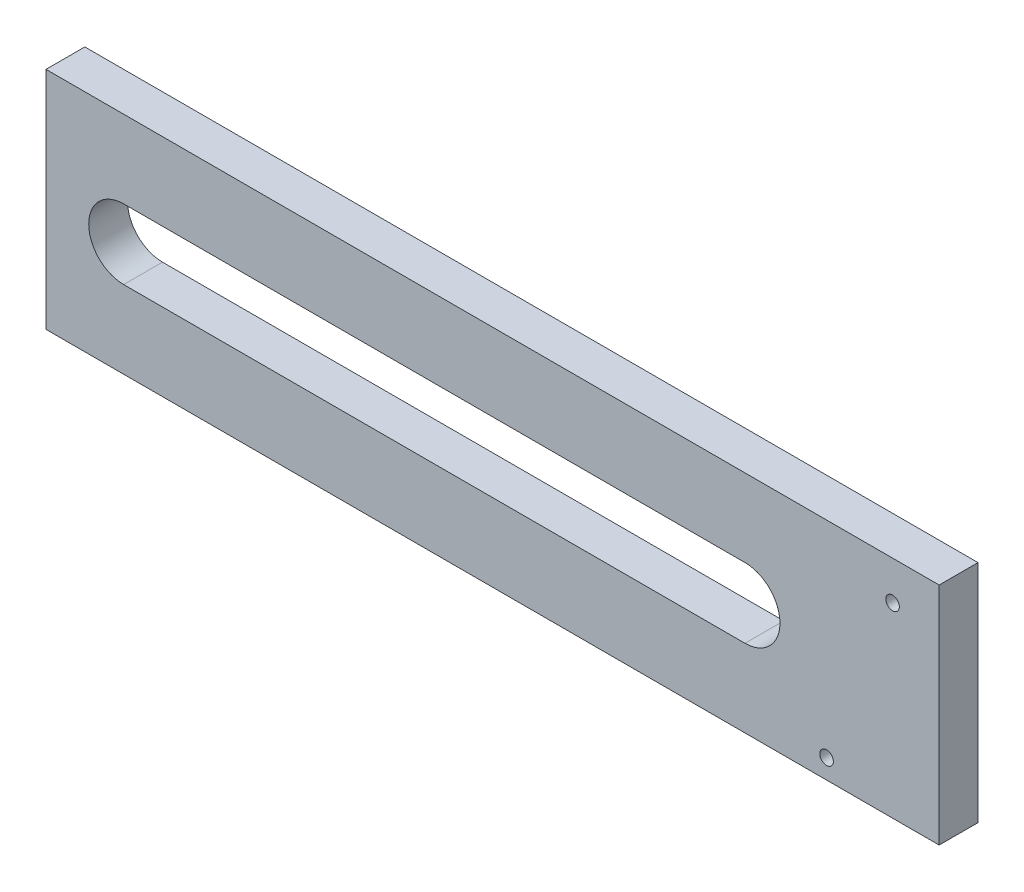
ISO-10303-21;
HEADER;
FILE_DESCRIPTION(('STEP AP214'),'2;1');
FILE_NAME('part.step','',(''),(''),'','','');
FILE_SCHEMA(('AUTOMOTIVE_DESIGN { 1 0 10303 214 1 1 1 1 }'));
ENDSEC;
DATA;
#1=APPLICATION_CONTEXT('core data for automotive mechanical design processes');
#2=APPLICATION_PROTOCOL_DEFINITION('international standard','automotive_design',2000,#1);
#3=PRODUCT_CONTEXT('',#1,'mechanical');
#4=PRODUCT('Part','Part','',(#3));
#5=PRODUCT_RELATED_PRODUCT_CATEGORY('part','',(#4));
#6=PRODUCT_DEFINITION_FORMATION('','',#4);
#7=PRODUCT_DEFINITION_CONTEXT('part definition',#1,'design');
#8=PRODUCT_DEFINITION('design','',#6,#7);
#9=PRODUCT_DEFINITION_SHAPE('','',#8);
#10=(LENGTH_UNIT() NAMED_UNIT(*) SI_UNIT(.MILLI.,.METRE.));
#11=(NAMED_UNIT(*) PLANE_ANGLE_UNIT() SI_UNIT($,.RADIAN.));
#12=(NAMED_UNIT(*) SI_UNIT($,.STERADIAN.) SOLID_ANGLE_UNIT());
#13=UNCERTAINTY_MEASURE_WITH_UNIT(LENGTH_MEASURE(1.E-05),#10,'distance_accuracy_value','');
#14=(GEOMETRIC_REPRESENTATION_CONTEXT(3) GLOBAL_UNCERTAINTY_ASSIGNED_CONTEXT((#13)) GLOBAL_UNIT_ASSIGNED_CONTEXT((#10,
#11,#12)) REPRESENTATION_CONTEXT('',''));
#15=CARTESIAN_POINT('',(0.,0.,0.));
#16=DIRECTION('',(0.,0.,1.));
#17=DIRECTION('',(1.,0.,0.));
#18=AXIS2_PLACEMENT_3D('',#15,#16,#17);
#19=CARTESIAN_POINT('',(-134.287380445586,-28.0215592245437,10.));
#20=DIRECTION('',(0.,0.,1.));
#21=DIRECTION('',(1.,0.,0.));
#22=AXIS2_PLACEMENT_3D('',#19,#20,#21);
#23=PLANE('',#22);
#24=CARTESIAN_POINT('',(83.712619554414,19.9784407754563,10.));
#25=DIRECTION('',(0.,0.,1.));
#26=DIRECTION('',(1.,0.,0.));
#27=AXIS2_PLACEMENT_3D('',#24,#25,#26);
#28=CIRCLE('',#27,1.75);
#29=CARTESIAN_POINT('',(85.462619554414,19.9784407754563,10.));
#30=VERTEX_POINT('',#29);
#31=EDGE_CURVE('E125',#30,#30,#28,.T.);
#32=ORIENTED_EDGE('',*,*,#31,.F.);
#33=EDGE_LOOP('',(#32));
#34=FACE_BOUND('',#33,.T.);
#35=DIRECTION('',(0.,-1.,0.));
#36=VECTOR('',#35,1.);
#37=CARTESIAN_POINT('',(-134.287380445586,29.9784407754563,10.));
#38=LINE('',#37,#36);
#39=CARTESIAN_POINT('',(-134.287380445586,29.9784407754563,10.));
#40=VERTEX_POINT('',#39);
#41=CARTESIAN_POINT('',(-134.287380445586,-28.0215592245437,10.));
#42=VERTEX_POINT('',#41);
#43=EDGE_CURVE('E135',#40,#42,#38,.T.);
#44=ORIENTED_EDGE('',*,*,#43,.T.);
#45=DIRECTION('',(1.,0.,0.));
#46=VECTOR('',#45,1.);
#47=CARTESIAN_POINT('',(-134.287380445586,-28.0215592245437,10.));
#48=LINE('',#47,#46);
#49=CARTESIAN_POINT('',(95.712619554414,-28.0215592245437,10.));
#50=VERTEX_POINT('',#49);
#51=EDGE_CURVE('E138',#42,#50,#48,.T.);
#52=ORIENTED_EDGE('',*,*,#51,.T.);
#53=DIRECTION('',(0.,1.,0.));
#54=VECTOR('',#53,1.);
#55=CARTESIAN_POINT('',(95.712619554414,29.9784407754563,10.));
#56=LINE('',#55,#54);
#57=CARTESIAN_POINT('',(95.712619554414,29.9784407754563,10.));
#58=VERTEX_POINT('',#57);
#59=EDGE_CURVE('E141',#50,#58,#56,.T.);
#60=ORIENTED_EDGE('',*,*,#59,.T.);
#61=DIRECTION('',(-1.,0.,0.));
#62=VECTOR('',#61,1.);
#63=CARTESIAN_POINT('',(-134.287380445586,29.9784407754563,10.));
#64=LINE('',#63,#62);
#65=EDGE_CURVE('E143',#58,#40,#64,.T.);
#66=ORIENTED_EDGE('',*,*,#65,.T.);
#67=EDGE_LOOP('',(#44,#52,#60,#66));
#68=FACE_BOUND('',#67,.T.);
#69=DIRECTION('',(-1.,0.,0.));
#70=VECTOR('',#69,1.);
#71=CARTESIAN_POINT('',(-114.287380445586,9.97844077545633,10.));
#72=LINE('',#71,#70);
#73=CARTESIAN_POINT('',(45.712619554414,9.97844077545633,10.));
#74=VERTEX_POINT('',#73);
#75=CARTESIAN_POINT('',(-114.287380445586,9.97844077545633,10.));
#76=VERTEX_POINT('',#75);
#77=EDGE_CURVE('E104',#74,#76,#72,.T.);
#78=ORIENTED_EDGE('',*,*,#77,.F.);
#79=CARTESIAN_POINT('',(45.712619554414,0.97844077545633,10.));
#80=DIRECTION('',(0.,0.,1.));
#81=DIRECTION('',(-1.,0.,0.));
#82=AXIS2_PLACEMENT_3D('',#79,#80,#81);
#83=CIRCLE('',#82,9.);
#84=CARTESIAN_POINT('',(45.712619554414,-8.02155922454367,10.));
#85=VERTEX_POINT('',#84);
#86=EDGE_CURVE('E96',#85,#74,#83,.T.);
#87=ORIENTED_EDGE('',*,*,#86,.F.);
#88=DIRECTION('',(1.,0.,0.));
#89=VECTOR('',#88,1.);
#90=CARTESIAN_POINT('',(45.712619554414,-8.02155922454367,10.));
#91=LINE('',#90,#89);
#92=CARTESIAN_POINT('',(-114.287380445586,-8.02155922454369,10.));
#93=VERTEX_POINT('',#92);
#94=EDGE_CURVE('E119',#93,#85,#91,.T.);
#95=ORIENTED_EDGE('',*,*,#94,.F.);
#96=CARTESIAN_POINT('',(-114.287380445586,0.978440775456321,10.));
#97=DIRECTION('',(0.,0.,1.));
#98=DIRECTION('',(1.,0.,0.));
#99=AXIS2_PLACEMENT_3D('',#96,#97,#98);
#100=CIRCLE('',#99,9.00000000000001);
#101=EDGE_CURVE('E117',#76,#93,#100,.T.);
#102=ORIENTED_EDGE('',*,*,#101,.F.);
#103=EDGE_LOOP('',(#78,#87,#95,#102));
#104=FACE_BOUND('',#103,.T.);
#105=CARTESIAN_POINT('',(66.712619554414,-23.0215592245437,10.));
#106=DIRECTION('',(0.,0.,1.));
#107=DIRECTION('',(1.,0.,0.));
#108=AXIS2_PLACEMENT_3D('',#105,#106,#107);
#109=CIRCLE('',#108,1.75);
#110=CARTESIAN_POINT('',(68.462619554414,-23.0215592245437,10.));
#111=VERTEX_POINT('',#110);
#112=EDGE_CURVE('E226',#111,#111,#109,.T.);
#113=ORIENTED_EDGE('',*,*,#112,.F.);
#114=EDGE_LOOP('',(#113));
#115=FACE_BOUND('',#114,.T.);
#116=ADVANCED_FACE('F31',(#34,#68,#104,#115),#23,.T.);
#117=CARTESIAN_POINT('',(-134.287380445586,-28.0215592245437,0.));
#118=DIRECTION('',(0.,0.,1.));
#119=DIRECTION('',(1.,0.,0.));
#120=AXIS2_PLACEMENT_3D('',#117,#118,#119);
#121=PLANE('',#120);
#122=CARTESIAN_POINT('',(83.712619554414,19.9784407754563,0.));
#123=DIRECTION('',(0.,0.,1.));
#124=DIRECTION('',(1.,0.,0.));
#125=AXIS2_PLACEMENT_3D('',#122,#123,#124);
#126=CIRCLE('',#125,1.75);
#127=CARTESIAN_POINT('',(85.462619554414,19.9784407754563,0.));
#128=VERTEX_POINT('',#127);
#129=EDGE_CURVE('E232',#128,#128,#126,.T.);
#130=ORIENTED_EDGE('',*,*,#129,.T.);
#131=EDGE_LOOP('',(#130));
#132=FACE_BOUND('',#131,.T.);
#133=DIRECTION('',(0.,-1.,0.));
#134=VECTOR('',#133,1.);
#135=CARTESIAN_POINT('',(-134.287380445586,29.9784407754563,0.));
#136=LINE('',#135,#134);
#137=CARTESIAN_POINT('',(-134.287380445586,29.9784407754563,0.));
#138=VERTEX_POINT('',#137);
#139=CARTESIAN_POINT('',(-134.287380445586,-28.0215592245437,0.));
#140=VERTEX_POINT('',#139);
#141=EDGE_CURVE('E112',#138,#140,#136,.T.);
#142=ORIENTED_EDGE('',*,*,#141,.F.);
#143=DIRECTION('',(-1.,0.,0.));
#144=VECTOR('',#143,1.);
#145=CARTESIAN_POINT('',(-134.287380445586,29.9784407754563,0.));
#146=LINE('',#145,#144);
#147=CARTESIAN_POINT('',(95.712619554414,29.9784407754563,0.));
#148=VERTEX_POINT('',#147);
#149=EDGE_CURVE('E139',#148,#138,#146,.T.);
#150=ORIENTED_EDGE('',*,*,#149,.F.);
#151=DIRECTION('',(0.,1.,0.));
#152=VECTOR('',#151,1.);
#153=CARTESIAN_POINT('',(95.712619554414,29.9784407754563,0.));
#154=LINE('',#153,#152);
#155=CARTESIAN_POINT('',(95.712619554414,-28.0215592245437,0.));
#156=VERTEX_POINT('',#155);
#157=EDGE_CURVE('E150',#156,#148,#154,.T.);
#158=ORIENTED_EDGE('',*,*,#157,.F.);
#159=DIRECTION('',(1.,0.,0.));
#160=VECTOR('',#159,1.);
#161=CARTESIAN_POINT('',(-134.287380445586,-28.0215592245437,0.));
#162=LINE('',#161,#160);
#163=EDGE_CURVE('E148',#140,#156,#162,.T.);
#164=ORIENTED_EDGE('',*,*,#163,.F.);
#165=EDGE_LOOP('',(#142,#150,#158,#164));
#166=FACE_BOUND('',#165,.T.);
#167=CARTESIAN_POINT('',(45.712619554414,0.97844077545633,0.));
#168=DIRECTION('',(0.,0.,1.));
#169=DIRECTION('',(-1.,0.,0.));
#170=AXIS2_PLACEMENT_3D('',#167,#168,#169);
#171=CIRCLE('',#170,9.);
#172=CARTESIAN_POINT('',(45.712619554414,-8.02155922454367,0.));
#173=VERTEX_POINT('',#172);
#174=CARTESIAN_POINT('',(45.712619554414,9.97844077545633,0.));
#175=VERTEX_POINT('',#174);
#176=EDGE_CURVE('E54',#173,#175,#171,.T.);
#177=ORIENTED_EDGE('',*,*,#176,.T.);
#178=DIRECTION('',(-1.,0.,0.));
#179=VECTOR('',#178,1.);
#180=CARTESIAN_POINT('',(-114.287380445586,9.97844077545633,0.));
#181=LINE('',#180,#179);
#182=CARTESIAN_POINT('',(-114.287380445586,9.97844077545633,0.));
#183=VERTEX_POINT('',#182);
#184=EDGE_CURVE('E111',#175,#183,#181,.T.);
#185=ORIENTED_EDGE('',*,*,#184,.T.);
#186=CARTESIAN_POINT('',(-114.287380445586,0.978440775456321,0.));
#187=DIRECTION('',(0.,0.,1.));
#188=DIRECTION('',(1.,0.,0.));
#189=AXIS2_PLACEMENT_3D('',#186,#187,#188);
#190=CIRCLE('',#189,9.00000000000001);
#191=CARTESIAN_POINT('',(-114.287380445586,-8.02155922454369,0.));
#192=VERTEX_POINT('',#191);
#193=EDGE_CURVE('E127',#183,#192,#190,.T.);
#194=ORIENTED_EDGE('',*,*,#193,.T.);
#195=DIRECTION('',(1.,0.,0.));
#196=VECTOR('',#195,1.);
#197=CARTESIAN_POINT('',(45.712619554414,-8.02155922454367,0.));
#198=LINE('',#197,#196);
#199=EDGE_CURVE('E105',#192,#173,#198,.T.);
#200=ORIENTED_EDGE('',*,*,#199,.T.);
#201=EDGE_LOOP('',(#177,#185,#194,#200));
#202=FACE_BOUND('',#201,.T.);
#203=CARTESIAN_POINT('',(66.712619554414,-23.0215592245437,0.));
#204=DIRECTION('',(0.,0.,1.));
#205=DIRECTION('',(1.,0.,0.));
#206=AXIS2_PLACEMENT_3D('',#203,#204,#205);
#207=CIRCLE('',#206,1.75);
#208=CARTESIAN_POINT('',(68.462619554414,-23.0215592245437,0.));
#209=VERTEX_POINT('',#208);
#210=EDGE_CURVE('E229',#209,#209,#207,.T.);
#211=ORIENTED_EDGE('',*,*,#210,.T.);
#212=EDGE_LOOP('',(#211));
#213=FACE_BOUND('',#212,.T.);
#214=ADVANCED_FACE('F168',(#132,#166,#202,#213),#121,.F.);
#215=CARTESIAN_POINT('',(-134.287380445586,29.9784407754563,10.));
#216=DIRECTION('',(1.,0.,0.));
#217=DIRECTION('',(0.,0.,-1.));
#218=AXIS2_PLACEMENT_3D('',#215,#216,#217);
#219=PLANE('',#218);
#220=ORIENTED_EDGE('',*,*,#141,.T.);
#221=DIRECTION('',(0.,0.,-1.));
#222=VECTOR('',#221,1.);
#223=CARTESIAN_POINT('',(-134.287380445586,-28.0215592245437,10.));
#224=LINE('',#223,#222);
#225=EDGE_CURVE('E11',#42,#140,#224,.T.);
#226=ORIENTED_EDGE('',*,*,#225,.F.);
#227=ORIENTED_EDGE('',*,*,#43,.F.);
#228=DIRECTION('',(0.,0.,-1.));
#229=VECTOR('',#228,1.);
#230=CARTESIAN_POINT('',(-134.287380445586,29.9784407754563,10.));
#231=LINE('',#230,#229);
#232=EDGE_CURVE('E145',#40,#138,#231,.T.);
#233=ORIENTED_EDGE('',*,*,#232,.T.);
#234=EDGE_LOOP('',(#220,#226,#227,#233));
#235=FACE_BOUND('',#234,.T.);
#236=ADVANCED_FACE('F33',(#235),#219,.F.);
#237=CARTESIAN_POINT('',(-134.287380445586,-28.0215592245437,10.));
#238=DIRECTION('',(0.,1.,0.));
#239=DIRECTION('',(0.,0.,1.));
#240=AXIS2_PLACEMENT_3D('',#237,#238,#239);
#241=PLANE('',#240);
#242=ORIENTED_EDGE('',*,*,#163,.T.);
#243=DIRECTION('',(0.,0.,-1.));
#244=VECTOR('',#243,1.);
#245=CARTESIAN_POINT('',(95.712619554414,-28.0215592245437,10.));
#246=LINE('',#245,#244);
#247=EDGE_CURVE('E39',#50,#156,#246,.T.);
#248=ORIENTED_EDGE('',*,*,#247,.F.);
#249=ORIENTED_EDGE('',*,*,#51,.F.);
#250=ORIENTED_EDGE('',*,*,#225,.T.);
#251=EDGE_LOOP('',(#242,#248,#249,#250));
#252=FACE_BOUND('',#251,.T.);
#253=ADVANCED_FACE('F178',(#252),#241,.F.);
#254=CARTESIAN_POINT('',(95.712619554414,29.9784407754563,10.));
#255=DIRECTION('',(-1.,0.,0.));
#256=DIRECTION('',(0.,0.,1.));
#257=AXIS2_PLACEMENT_3D('',#254,#255,#256);
#258=PLANE('',#257);
#259=ORIENTED_EDGE('',*,*,#157,.T.);
#260=DIRECTION('',(0.,0.,-1.));
#261=VECTOR('',#260,1.);
#262=CARTESIAN_POINT('',(95.712619554414,29.9784407754563,10.));
#263=LINE('',#262,#261);
#264=EDGE_CURVE('E155',#58,#148,#263,.T.);
#265=ORIENTED_EDGE('',*,*,#264,.F.);
#266=ORIENTED_EDGE('',*,*,#59,.F.);
#267=ORIENTED_EDGE('',*,*,#247,.T.);
#268=EDGE_LOOP('',(#259,#265,#266,#267));
#269=FACE_BOUND('',#268,.T.);
#270=ADVANCED_FACE('F162',(#269),#258,.F.);
#271=CARTESIAN_POINT('',(-134.287380445586,29.9784407754563,10.));
#272=DIRECTION('',(0.,-1.,0.));
#273=DIRECTION('',(0.,0.,-1.));
#274=AXIS2_PLACEMENT_3D('',#271,#272,#273);
#275=PLANE('',#274);
#276=ORIENTED_EDGE('',*,*,#149,.T.);
#277=ORIENTED_EDGE('',*,*,#232,.F.);
#278=ORIENTED_EDGE('',*,*,#65,.F.);
#279=ORIENTED_EDGE('',*,*,#264,.T.);
#280=EDGE_LOOP('',(#276,#277,#278,#279));
#281=FACE_BOUND('',#280,.T.);
#282=ADVANCED_FACE('F172',(#281),#275,.F.);
#283=CARTESIAN_POINT('',(45.712619554414,0.97844077545633,10.));
#284=DIRECTION('',(0.,0.,-1.));
#285=DIRECTION('',(-1.,0.,0.));
#286=AXIS2_PLACEMENT_3D('',#283,#284,#285);
#287=CYLINDRICAL_SURFACE('',#286,9.);
#288=ORIENTED_EDGE('',*,*,#176,.F.);
#289=DIRECTION('',(0.,0.,-1.));
#290=VECTOR('',#289,1.);
#291=CARTESIAN_POINT('',(45.712619554414,-8.02155922454367,10.));
#292=LINE('',#291,#290);
#293=EDGE_CURVE('E100',#85,#173,#292,.T.);
#294=ORIENTED_EDGE('',*,*,#293,.F.);
#295=ORIENTED_EDGE('',*,*,#86,.T.);
#296=DIRECTION('',(0.,0.,-1.));
#297=VECTOR('',#296,1.);
#298=CARTESIAN_POINT('',(45.712619554414,9.97844077545633,10.));
#299=LINE('',#298,#297);
#300=EDGE_CURVE('E99',#74,#175,#299,.T.);
#301=ORIENTED_EDGE('',*,*,#300,.T.);
#302=EDGE_LOOP('',(#288,#294,#295,#301));
#303=FACE_BOUND('',#302,.T.);
#304=ADVANCED_FACE('F98',(#303),#287,.F.);
#305=CARTESIAN_POINT('',(-114.287380445586,9.97844077545633,10.));
#306=DIRECTION('',(0.,-1.,0.));
#307=DIRECTION('',(1.,0.,0.));
#308=AXIS2_PLACEMENT_3D('',#305,#306,#307);
#309=PLANE('',#308);
#310=ORIENTED_EDGE('',*,*,#184,.F.);
#311=ORIENTED_EDGE('',*,*,#300,.F.);
#312=ORIENTED_EDGE('',*,*,#77,.T.);
#313=DIRECTION('',(0.,0.,-1.));
#314=VECTOR('',#313,1.);
#315=CARTESIAN_POINT('',(-114.287380445586,9.97844077545633,10.));
#316=LINE('',#315,#314);
#317=EDGE_CURVE('E113',#76,#183,#316,.T.);
#318=ORIENTED_EDGE('',*,*,#317,.T.);
#319=EDGE_LOOP('',(#310,#311,#312,#318));
#320=FACE_BOUND('',#319,.T.);
#321=ADVANCED_FACE('F108',(#320),#309,.T.);
#322=CARTESIAN_POINT('',(-114.287380445586,0.978440775456321,10.));
#323=DIRECTION('',(0.,0.,-1.));
#324=DIRECTION('',(-1.,0.,0.));
#325=AXIS2_PLACEMENT_3D('',#322,#323,#324);
#326=CYLINDRICAL_SURFACE('',#325,9.00000000000001);
#327=ORIENTED_EDGE('',*,*,#193,.F.);
#328=ORIENTED_EDGE('',*,*,#317,.F.);
#329=ORIENTED_EDGE('',*,*,#101,.T.);
#330=DIRECTION('',(0.,0.,-1.));
#331=VECTOR('',#330,1.);
#332=CARTESIAN_POINT('',(-114.287380445586,-8.02155922454369,10.));
#333=LINE('',#332,#331);
#334=EDGE_CURVE('E46',#93,#192,#333,.T.);
#335=ORIENTED_EDGE('',*,*,#334,.T.);
#336=EDGE_LOOP('',(#327,#328,#329,#335));
#337=FACE_BOUND('',#336,.T.);
#338=ADVANCED_FACE('F204',(#337),#326,.F.);
#339=CARTESIAN_POINT('',(45.712619554414,-8.02155922454367,10.));
#340=DIRECTION('',(0.,1.,0.));
#341=DIRECTION('',(-1.,0.,0.));
#342=AXIS2_PLACEMENT_3D('',#339,#340,#341);
#343=PLANE('',#342);
#344=ORIENTED_EDGE('',*,*,#199,.F.);
#345=ORIENTED_EDGE('',*,*,#334,.F.);
#346=ORIENTED_EDGE('',*,*,#94,.T.);
#347=ORIENTED_EDGE('',*,*,#293,.T.);
#348=EDGE_LOOP('',(#344,#345,#346,#347));
#349=FACE_BOUND('',#348,.T.);
#350=ADVANCED_FACE('F208',(#349),#343,.T.);
#351=CARTESIAN_POINT('',(83.712619554414,19.9784407754563,10.));
#352=DIRECTION('',(0.,0.,-1.));
#353=DIRECTION('',(-1.,0.,0.));
#354=AXIS2_PLACEMENT_3D('',#351,#352,#353);
#355=CYLINDRICAL_SURFACE('',#354,1.75);
#356=ORIENTED_EDGE('',*,*,#31,.T.);
#357=EDGE_LOOP('',(#356));
#358=FACE_BOUND('',#357,.T.);
#359=ORIENTED_EDGE('',*,*,#129,.F.);
#360=EDGE_LOOP('',(#359));
#361=FACE_BOUND('',#360,.T.);
#362=ADVANCED_FACE('F214',(#358,#361),#355,.F.);
#363=CARTESIAN_POINT('',(66.712619554414,-23.0215592245437,10.));
#364=DIRECTION('',(0.,0.,-1.));
#365=DIRECTION('',(-1.,0.,0.));
#366=AXIS2_PLACEMENT_3D('',#363,#364,#365);
#367=CYLINDRICAL_SURFACE('',#366,1.75);
#368=ORIENTED_EDGE('',*,*,#112,.T.);
#369=EDGE_LOOP('',(#368));
#370=FACE_BOUND('',#369,.T.);
#371=ORIENTED_EDGE('',*,*,#210,.F.);
#372=EDGE_LOOP('',(#371));
#373=FACE_BOUND('',#372,.T.);
#374=ADVANCED_FACE('F217',(#370,#373),#367,.F.);
#375=CLOSED_SHELL('',(#116,#214,#236,#253,#270,#282,#304,#321,#338,#350,#362,#374));
#376=MANIFOLD_SOLID_BREP('B2',#375);
#377=ADVANCED_BREP_SHAPE_REPRESENTATION('',(#18,#376),#14);
#378=SHAPE_DEFINITION_REPRESENTATION(#9,#377);
ENDSEC;
END-ISO-10303-21;
